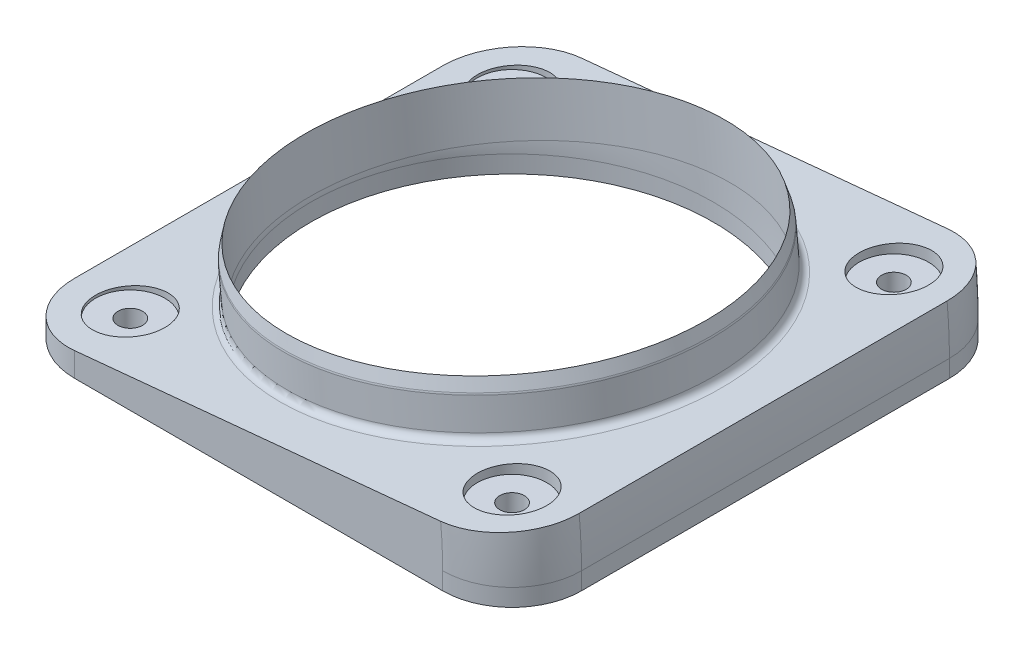
ISO-10303-21;
HEADER;
FILE_DESCRIPTION(('STEP AP214'),'2;1');
FILE_NAME('part.step','',(''),(''),'','','');
FILE_SCHEMA(('AUTOMOTIVE_DESIGN { 1 0 10303 214 1 1 1 1 }'));
ENDSEC;
DATA;
#1=APPLICATION_CONTEXT('core data for automotive mechanical design processes');
#2=APPLICATION_PROTOCOL_DEFINITION('international standard','automotive_design',2000,#1);
#3=PRODUCT_CONTEXT('',#1,'mechanical');
#4=PRODUCT('Part','Part','',(#3));
#5=PRODUCT_RELATED_PRODUCT_CATEGORY('part','',(#4));
#6=PRODUCT_DEFINITION_FORMATION('','',#4);
#7=PRODUCT_DEFINITION_CONTEXT('part definition',#1,'design');
#8=PRODUCT_DEFINITION('design','',#6,#7);
#9=PRODUCT_DEFINITION_SHAPE('','',#8);
#10=(LENGTH_UNIT() NAMED_UNIT(*) SI_UNIT(.MILLI.,.METRE.));
#11=(NAMED_UNIT(*) PLANE_ANGLE_UNIT() SI_UNIT($,.RADIAN.));
#12=(NAMED_UNIT(*) SI_UNIT($,.STERADIAN.) SOLID_ANGLE_UNIT());
#13=UNCERTAINTY_MEASURE_WITH_UNIT(LENGTH_MEASURE(1.E-05),#10,'distance_accuracy_value','');
#14=(GEOMETRIC_REPRESENTATION_CONTEXT(3) GLOBAL_UNCERTAINTY_ASSIGNED_CONTEXT((#13)) GLOBAL_UNIT_ASSIGNED_CONTEXT((#10,
#11,#12)) REPRESENTATION_CONTEXT('',''));
#15=CARTESIAN_POINT('',(0.,0.,0.));
#16=DIRECTION('',(0.,0.,1.));
#17=DIRECTION('',(1.,0.,0.));
#18=AXIS2_PLACEMENT_3D('',#15,#16,#17);
#19=CARTESIAN_POINT('',(-0.213409224689429,4.44292985807499,0.));
#20=DIRECTION('',(-0.0958457525202242,0.995396198367179,0.));
#21=DIRECTION('',(0.,0.,1.));
#22=AXIS2_PLACEMENT_3D('',#19,#20,#21);
#23=PLANE('',#22);
#24=CARTESIAN_POINT('',(34.9250000000004,7.82637383749599,34.9249999999996));
#25=DIRECTION('',(-0.0958457525202242,0.995396198367179,0.));
#26=DIRECTION('',(-0.995396198367179,-0.0958457525202242,0.));
#27=AXIS2_PLACEMENT_3D('',#24,#25,#26);
#28=ELLIPSE('',#27,6.37936935103467,6.35);
#29=CARTESIAN_POINT('',(28.5750000000003,7.21493838144162,34.9249999999996));
#30=VERTEX_POINT('',#29);
#31=EDGE_CURVE('E37',#30,#30,#28,.T.);
#32=ORIENTED_EDGE('',*,*,#31,.F.);
#33=EDGE_LOOP('',(#32));
#34=FACE_BOUND('',#33,.T.);
#35=CARTESIAN_POINT('',(34.925,7.82637383749596,-34.925));
#36=DIRECTION('',(-0.0958457525202242,0.995396198367179,0.));
#37=DIRECTION('',(-0.995396198367179,-0.0958457525202242,0.));
#38=AXIS2_PLACEMENT_3D('',#35,#36,#37);
#39=ELLIPSE('',#38,6.37936935103467,6.35);
#40=CARTESIAN_POINT('',(28.575,7.21493838144158,-34.925));
#41=VERTEX_POINT('',#40);
#42=EDGE_CURVE('E207',#41,#41,#39,.T.);
#43=ORIENTED_EDGE('',*,*,#42,.F.);
#44=EDGE_LOOP('',(#43));
#45=FACE_BOUND('',#44,.T.);
#46=CARTESIAN_POINT('',(-34.9250000000001,1.10058382089786,-34.9249999999999));
#47=DIRECTION('',(-0.0958457525202242,0.995396198367179,0.));
#48=DIRECTION('',(-0.995396198367179,-0.0958457525202242,0.));
#49=AXIS2_PLACEMENT_3D('',#46,#47,#48);
#50=ELLIPSE('',#49,6.37936935103467,6.35);
#51=CARTESIAN_POINT('',(-41.2750000000001,0.489148364843487,-34.9249999999999));
#52=VERTEX_POINT('',#51);
#53=EDGE_CURVE('E200',#52,#52,#50,.T.);
#54=ORIENTED_EDGE('',*,*,#53,.F.);
#55=EDGE_LOOP('',(#54));
#56=FACE_BOUND('',#55,.T.);
#57=CARTESIAN_POINT('',(-34.925,1.10058382089787,34.925));
#58=DIRECTION('',(-0.0958457525202242,0.995396198367179,0.));
#59=DIRECTION('',(-0.995396198367179,-0.0958457525202242,0.));
#60=AXIS2_PLACEMENT_3D('',#57,#58,#59);
#61=ELLIPSE('',#60,6.37936935103467,6.35);
#62=CARTESIAN_POINT('',(-41.275,0.489148364843497,34.925));
#63=VERTEX_POINT('',#62);
#64=EDGE_CURVE('E193',#63,#63,#61,.T.);
#65=ORIENTED_EDGE('',*,*,#64,.F.);
#66=EDGE_LOOP('',(#65));
#67=FACE_BOUND('',#66,.T.);
#68=CARTESIAN_POINT('',(-0.213409224689429,4.44292985807499,0.));
#69=DIRECTION('',(-0.0958457525202242,0.995396198367179,0.));
#70=DIRECTION('',(-0.995396198367179,-0.0958457525202242,0.));
#71=AXIS2_PLACEMENT_3D('',#68,#69,#70);
#72=CIRCLE('',#71,38.735);
#73=CARTESIAN_POINT('',(-38.7700809684421,0.730344634204105,0.));
#74=VERTEX_POINT('',#73);
#75=EDGE_CURVE('E11',#74,#74,#72,.F.);
#76=ORIENTED_EDGE('',*,*,#75,.T.);
#77=EDGE_LOOP('',(#76));
#78=FACE_BOUND('',#77,.T.);
#79=DIRECTION('',(0.995396198367179,0.0958457525202242,0.));
#80=VECTOR('',#79,1.);
#81=CARTESIAN_POINT('',(45.9281815506211,8.88585971614999,46.355));
#82=LINE('',#81,#80);
#83=CARTESIAN_POINT('',(-33.655,1.22287091210875,46.355));
#84=VERTEX_POINT('',#83);
#85=CARTESIAN_POINT('',(33.286649831358,7.66861865914314,46.355));
#86=VERTEX_POINT('',#85);
#87=EDGE_CURVE('E120',#84,#86,#82,.T.);
#88=ORIENTED_EDGE('',*,*,#87,.T.);
#89=CARTESIAN_POINT('',(33.286649831358,7.66861865914314,33.655));
#90=DIRECTION('',(-0.0958457525202242,0.995396198367179,0.));
#91=DIRECTION('',(-0.995396198367179,-0.0958457525202242,0.));
#92=AXIS2_PLACEMENT_3D('',#89,#90,#91);
#93=CIRCLE('',#92,12.7);
#94=CARTESIAN_POINT('',(45.9281815506211,8.88585971614999,33.655));
#95=VERTEX_POINT('',#94);
#96=EDGE_CURVE('E115',#86,#95,#93,.T.);
#97=ORIENTED_EDGE('',*,*,#96,.T.);
#98=DIRECTION('',(0.,0.,-1.));
#99=VECTOR('',#98,1.);
#100=CARTESIAN_POINT('',(45.9281815506211,8.88585971614999,46.355));
#101=LINE('',#100,#99);
#102=CARTESIAN_POINT('',(45.9281815506211,8.88585971614999,-33.655));
#103=VERTEX_POINT('',#102);
#104=EDGE_CURVE('E117',#95,#103,#101,.T.);
#105=ORIENTED_EDGE('',*,*,#104,.T.);
#106=CARTESIAN_POINT('',(33.286649831358,7.66861865914314,-33.655));
#107=DIRECTION('',(-0.0958457525202242,0.995396198367179,0.));
#108=DIRECTION('',(-0.995396198367179,-0.0958457525202242,0.));
#109=AXIS2_PLACEMENT_3D('',#106,#107,#108);
#110=CIRCLE('',#109,12.7);
#111=CARTESIAN_POINT('',(33.286649831358,7.66861865914314,-46.355));
#112=VERTEX_POINT('',#111);
#113=EDGE_CURVE('E125',#103,#112,#110,.T.);
#114=ORIENTED_EDGE('',*,*,#113,.T.);
#115=DIRECTION('',(-0.995396198367179,-0.0958457525202242,0.));
#116=VECTOR('',#115,1.);
#117=CARTESIAN_POINT('',(45.9281815506211,8.88585971614999,-46.355));
#118=LINE('',#117,#116);
#119=CARTESIAN_POINT('',(-33.655,1.22287091210875,-46.355));
#120=VERTEX_POINT('',#119);
#121=EDGE_CURVE('E134',#112,#120,#118,.T.);
#122=ORIENTED_EDGE('',*,*,#121,.T.);
#123=CARTESIAN_POINT('',(-33.655,1.22287091210874,-33.655));
#124=DIRECTION('',(-0.0958457525202242,0.995396198367179,0.));
#125=DIRECTION('',(0.995396198367179,0.0958457525202242,0.));
#126=AXIS2_PLACEMENT_3D('',#123,#124,#125);
#127=ELLIPSE('',#126,12.7587387020693,12.7);
#128=CARTESIAN_POINT('',(-46.355,0.,-33.655));
#129=VERTEX_POINT('',#128);
#130=EDGE_CURVE('E152',#120,#129,#127,.T.);
#131=ORIENTED_EDGE('',*,*,#130,.T.);
#132=DIRECTION('',(0.,0.,1.));
#133=VECTOR('',#132,1.);
#134=CARTESIAN_POINT('',(-46.355,0.,46.355));
#135=LINE('',#134,#133);
#136=CARTESIAN_POINT('',(-46.355,0.,33.655));
#137=VERTEX_POINT('',#136);
#138=EDGE_CURVE('E252',#129,#137,#135,.T.);
#139=ORIENTED_EDGE('',*,*,#138,.T.);
#140=CARTESIAN_POINT('',(-33.655,1.22287091210874,33.655));
#141=DIRECTION('',(-0.0958457525202242,0.995396198367179,0.));
#142=DIRECTION('',(0.995396198367179,0.0958457525202242,0.));
#143=AXIS2_PLACEMENT_3D('',#140,#141,#142);
#144=ELLIPSE('',#143,12.7587387020693,12.7);
#145=EDGE_CURVE('E150',#137,#84,#144,.T.);
#146=ORIENTED_EDGE('',*,*,#145,.T.);
#147=EDGE_LOOP('',(#88,#97,#105,#114,#122,#131,#139,#146));
#148=FACE_BOUND('',#147,.T.);
#149=ADVANCED_FACE('F33',(#34,#45,#56,#67,#78,#148),#23,.T.);
#150=CARTESIAN_POINT('',(-46.355,-3.175,46.355));
#151=DIRECTION('',(-1.,0.,0.));
#152=DIRECTION('',(0.,0.,1.));
#153=AXIS2_PLACEMENT_3D('',#150,#151,#152);
#154=PLANE('',#153);
#155=ORIENTED_EDGE('',*,*,#138,.F.);
#156=DIRECTION('',(0.,1.,0.));
#157=VECTOR('',#156,1.);
#158=CARTESIAN_POINT('',(-46.355,-3.175,-33.655));
#159=LINE('',#158,#157);
#160=CARTESIAN_POINT('',(-46.355,-3.175,-33.655));
#161=VERTEX_POINT('',#160);
#162=EDGE_CURVE('E165',#129,#161,#159,.F.);
#163=ORIENTED_EDGE('',*,*,#162,.T.);
#164=DIRECTION('',(0.,0.,1.));
#165=VECTOR('',#164,1.);
#166=CARTESIAN_POINT('',(-46.355,-3.175,46.355));
#167=LINE('',#166,#165);
#168=CARTESIAN_POINT('',(-46.355,-3.175,33.655));
#169=VERTEX_POINT('',#168);
#170=EDGE_CURVE('E253',#161,#169,#167,.T.);
#171=ORIENTED_EDGE('',*,*,#170,.T.);
#172=DIRECTION('',(0.,1.,0.));
#173=VECTOR('',#172,1.);
#174=CARTESIAN_POINT('',(-46.355,-3.175,33.655));
#175=LINE('',#174,#173);
#176=EDGE_CURVE('E162',#169,#137,#175,.T.);
#177=ORIENTED_EDGE('',*,*,#176,.T.);
#178=EDGE_LOOP('',(#155,#163,#171,#177));
#179=FACE_BOUND('',#178,.T.);
#180=ADVANCED_FACE('F281',(#179),#154,.T.);
#181=CARTESIAN_POINT('',(46.355,-3.175,-46.355));
#182=DIRECTION('',(0.,0.,-1.));
#183=DIRECTION('',(-1.,0.,0.));
#184=AXIS2_PLACEMENT_3D('',#181,#182,#183);
#185=PLANE('',#184);
#186=DIRECTION('',(-1.,0.,0.));
#187=VECTOR('',#186,1.);
#188=CARTESIAN_POINT('',(46.355,-3.175,-46.355));
#189=LINE('',#188,#187);
#190=CARTESIAN_POINT('',(33.655,-3.175,-46.355));
#191=VERTEX_POINT('',#190);
#192=CARTESIAN_POINT('',(-33.655,-3.175,-46.355));
#193=VERTEX_POINT('',#192);
#194=EDGE_CURVE('E143',#191,#193,#189,.T.);
#195=ORIENTED_EDGE('',*,*,#194,.T.);
#196=DIRECTION('',(0.,1.,0.));
#197=VECTOR('',#196,1.);
#198=CARTESIAN_POINT('',(-33.655,-3.175,-46.355));
#199=LINE('',#198,#197);
#200=EDGE_CURVE('E159',#193,#120,#199,.T.);
#201=ORIENTED_EDGE('',*,*,#200,.T.);
#202=ORIENTED_EDGE('',*,*,#121,.F.);
#203=CARTESIAN_POINT('',(-46.355,0.,-46.355));
#204=DIRECTION('',(0.,0.,-1.));
#205=DIRECTION('',(-1.,0.,0.));
#206=AXIS2_PLACEMENT_3D('',#203,#204,#205);
#207=CIRCLE('',#206,80.01);
#208=CARTESIAN_POINT('',(33.655,0.,-46.355));
#209=VERTEX_POINT('',#208);
#210=EDGE_CURVE('E156',#112,#209,#207,.T.);
#211=ORIENTED_EDGE('',*,*,#210,.T.);
#212=DIRECTION('',(0.,1.,0.));
#213=VECTOR('',#212,1.);
#214=CARTESIAN_POINT('',(33.655,-3.175,-46.355));
#215=LINE('',#214,#213);
#216=EDGE_CURVE('E124',#209,#191,#215,.F.);
#217=ORIENTED_EDGE('',*,*,#216,.T.);
#218=EDGE_LOOP('',(#195,#201,#202,#211,#217));
#219=FACE_BOUND('',#218,.T.);
#220=ADVANCED_FACE('F275',(#219),#185,.T.);
#221=CARTESIAN_POINT('',(46.355,-3.175,46.355));
#222=DIRECTION('',(1.,0.,0.));
#223=DIRECTION('',(0.,0.,-1.));
#224=AXIS2_PLACEMENT_3D('',#221,#222,#223);
#225=PLANE('',#224);
#226=DIRECTION('',(0.,0.,-1.));
#227=VECTOR('',#226,1.);
#228=CARTESIAN_POINT('',(46.355,0.,46.355));
#229=LINE('',#228,#227);
#230=CARTESIAN_POINT('',(46.355,0.,33.655));
#231=VERTEX_POINT('',#230);
#232=CARTESIAN_POINT('',(46.355,0.,-33.655));
#233=VERTEX_POINT('',#232);
#234=EDGE_CURVE('E257',#231,#233,#229,.T.);
#235=ORIENTED_EDGE('',*,*,#234,.F.);
#236=DIRECTION('',(0.,1.,0.));
#237=VECTOR('',#236,1.);
#238=CARTESIAN_POINT('',(46.355,-3.175,33.655));
#239=LINE('',#238,#237);
#240=CARTESIAN_POINT('',(46.355,-3.175,33.655));
#241=VERTEX_POINT('',#240);
#242=EDGE_CURVE('E57',#231,#241,#239,.F.);
#243=ORIENTED_EDGE('',*,*,#242,.T.);
#244=DIRECTION('',(0.,0.,-1.));
#245=VECTOR('',#244,1.);
#246=CARTESIAN_POINT('',(46.355,-3.175,46.355));
#247=LINE('',#246,#245);
#248=CARTESIAN_POINT('',(46.355,-3.175,-33.655));
#249=VERTEX_POINT('',#248);
#250=EDGE_CURVE('E260',#241,#249,#247,.T.);
#251=ORIENTED_EDGE('',*,*,#250,.T.);
#252=DIRECTION('',(0.,1.,0.));
#253=VECTOR('',#252,1.);
#254=CARTESIAN_POINT('',(46.355,-3.175,-33.655));
#255=LINE('',#254,#253);
#256=EDGE_CURVE('E174',#249,#233,#255,.T.);
#257=ORIENTED_EDGE('',*,*,#256,.T.);
#258=EDGE_LOOP('',(#235,#243,#251,#257));
#259=FACE_BOUND('',#258,.T.);
#260=ADVANCED_FACE('F298',(#259),#225,.T.);
#261=CARTESIAN_POINT('',(46.355,-3.175,46.355));
#262=DIRECTION('',(0.,0.,1.));
#263=DIRECTION('',(1.,0.,0.));
#264=AXIS2_PLACEMENT_3D('',#261,#262,#263);
#265=PLANE('',#264);
#266=ORIENTED_EDGE('',*,*,#87,.F.);
#267=DIRECTION('',(0.,1.,0.));
#268=VECTOR('',#267,1.);
#269=CARTESIAN_POINT('',(-33.655,-3.175,46.355));
#270=LINE('',#269,#268);
#271=CARTESIAN_POINT('',(-33.655,-3.175,46.355));
#272=VERTEX_POINT('',#271);
#273=EDGE_CURVE('E148',#84,#272,#270,.F.);
#274=ORIENTED_EDGE('',*,*,#273,.T.);
#275=DIRECTION('',(1.,0.,0.));
#276=VECTOR('',#275,1.);
#277=CARTESIAN_POINT('',(46.355,-3.175,46.355));
#278=LINE('',#277,#276);
#279=CARTESIAN_POINT('',(33.655,-3.175,46.355));
#280=VERTEX_POINT('',#279);
#281=EDGE_CURVE('E256',#272,#280,#278,.T.);
#282=ORIENTED_EDGE('',*,*,#281,.T.);
#283=DIRECTION('',(0.,1.,0.));
#284=VECTOR('',#283,1.);
#285=CARTESIAN_POINT('',(33.655,-3.175,46.355));
#286=LINE('',#285,#284);
#287=CARTESIAN_POINT('',(33.655,0.,46.355));
#288=VERTEX_POINT('',#287);
#289=EDGE_CURVE('E139',#280,#288,#286,.T.);
#290=ORIENTED_EDGE('',*,*,#289,.T.);
#291=CARTESIAN_POINT('',(-46.355,0.,46.355));
#292=DIRECTION('',(0.,0.,1.));
#293=DIRECTION('',(1.,0.,0.));
#294=AXIS2_PLACEMENT_3D('',#291,#292,#293);
#295=CIRCLE('',#294,80.01);
#296=EDGE_CURVE('E141',#288,#86,#295,.T.);
#297=ORIENTED_EDGE('',*,*,#296,.T.);
#298=EDGE_LOOP('',(#266,#274,#282,#290,#297));
#299=FACE_BOUND('',#298,.T.);
#300=ADVANCED_FACE('F293',(#299),#265,.T.);
#301=CARTESIAN_POINT('',(0.,-3.175,0.));
#302=DIRECTION('',(0.,1.,0.));
#303=DIRECTION('',(0.,0.,1.));
#304=AXIS2_PLACEMENT_3D('',#301,#302,#303);
#305=PLANE('',#304);
#306=CARTESIAN_POINT('',(34.9250000000004,-3.175,34.9249999999996));
#307=DIRECTION('',(0.,-1.,0.));
#308=DIRECTION('',(1.,0.,0.));
#309=AXIS2_PLACEMENT_3D('',#306,#307,#308);
#310=CIRCLE('',#309,2.25);
#311=CARTESIAN_POINT('',(37.1750000000004,-3.175,34.9249999999996));
#312=VERTEX_POINT('',#311);
#313=EDGE_CURVE('E179',#312,#312,#310,.T.);
#314=ORIENTED_EDGE('',*,*,#313,.F.);
#315=EDGE_LOOP('',(#314));
#316=FACE_BOUND('',#315,.T.);
#317=CARTESIAN_POINT('',(-34.925,-3.175,34.925));
#318=DIRECTION('',(0.,-1.,0.));
#319=DIRECTION('',(0.,0.,1.));
#320=AXIS2_PLACEMENT_3D('',#317,#318,#319);
#321=CIRCLE('',#320,2.25);
#322=CARTESIAN_POINT('',(-34.925,-3.175,37.175));
#323=VERTEX_POINT('',#322);
#324=EDGE_CURVE('E231',#323,#323,#321,.T.);
#325=ORIENTED_EDGE('',*,*,#324,.F.);
#326=EDGE_LOOP('',(#325));
#327=FACE_BOUND('',#326,.T.);
#328=CARTESIAN_POINT('',(-34.9250000000001,-3.175,-34.9249999999999));
#329=DIRECTION('',(0.,-1.,0.));
#330=DIRECTION('',(-1.,0.,0.));
#331=AXIS2_PLACEMENT_3D('',#328,#329,#330);
#332=CIRCLE('',#331,2.25);
#333=CARTESIAN_POINT('',(-37.1750000000001,-3.175,-34.9249999999999));
#334=VERTEX_POINT('',#333);
#335=EDGE_CURVE('E234',#334,#334,#332,.T.);
#336=ORIENTED_EDGE('',*,*,#335,.F.);
#337=EDGE_LOOP('',(#336));
#338=FACE_BOUND('',#337,.T.);
#339=CARTESIAN_POINT('',(34.925,-3.175,-34.925));
#340=DIRECTION('',(0.,-1.,0.));
#341=DIRECTION('',(0.,0.,-1.));
#342=AXIS2_PLACEMENT_3D('',#339,#340,#341);
#343=CIRCLE('',#342,2.25);
#344=CARTESIAN_POINT('',(34.925,-3.175,-37.175));
#345=VERTEX_POINT('',#344);
#346=EDGE_CURVE('E237',#345,#345,#343,.T.);
#347=ORIENTED_EDGE('',*,*,#346,.F.);
#348=EDGE_LOOP('',(#347));
#349=FACE_BOUND('',#348,.T.);
#350=CARTESIAN_POINT('',(0.,-3.175,0.));
#351=DIRECTION('',(0.,1.,0.));
#352=DIRECTION('',(0.,0.,1.));
#353=AXIS2_PLACEMENT_3D('',#350,#351,#352);
#354=CIRCLE('',#353,36.83);
#355=CARTESIAN_POINT('',(0.,-3.175,36.83));
#356=VERTEX_POINT('',#355);
#357=EDGE_CURVE('E249',#356,#356,#354,.T.);
#358=ORIENTED_EDGE('',*,*,#357,.T.);
#359=EDGE_LOOP('',(#358));
#360=FACE_BOUND('',#359,.T.);
#361=ORIENTED_EDGE('',*,*,#170,.F.);
#362=CARTESIAN_POINT('',(-33.655,-3.175,-33.655));
#363=DIRECTION('',(0.,1.,0.));
#364=DIRECTION('',(0.,0.,1.));
#365=AXIS2_PLACEMENT_3D('',#362,#363,#364);
#366=CIRCLE('',#365,12.7);
#367=EDGE_CURVE('E172',#161,#193,#366,.F.);
#368=ORIENTED_EDGE('',*,*,#367,.T.);
#369=ORIENTED_EDGE('',*,*,#194,.F.);
#370=CARTESIAN_POINT('',(33.655,-3.175,-33.655));
#371=DIRECTION('',(0.,1.,0.));
#372=DIRECTION('',(0.,0.,1.));
#373=AXIS2_PLACEMENT_3D('',#370,#371,#372);
#374=CIRCLE('',#373,12.7);
#375=EDGE_CURVE('E50',#191,#249,#374,.F.);
#376=ORIENTED_EDGE('',*,*,#375,.T.);
#377=ORIENTED_EDGE('',*,*,#250,.F.);
#378=CARTESIAN_POINT('',(33.655,-3.175,33.655));
#379=DIRECTION('',(0.,1.,0.));
#380=DIRECTION('',(0.,0.,1.));
#381=AXIS2_PLACEMENT_3D('',#378,#379,#380);
#382=CIRCLE('',#381,12.7);
#383=EDGE_CURVE('E168',#241,#280,#382,.F.);
#384=ORIENTED_EDGE('',*,*,#383,.T.);
#385=ORIENTED_EDGE('',*,*,#281,.F.);
#386=CARTESIAN_POINT('',(-33.655,-3.175,33.655));
#387=DIRECTION('',(0.,1.,0.));
#388=DIRECTION('',(0.,0.,1.));
#389=AXIS2_PLACEMENT_3D('',#386,#387,#388);
#390=CIRCLE('',#389,12.7);
#391=EDGE_CURVE('E170',#272,#169,#390,.F.);
#392=ORIENTED_EDGE('',*,*,#391,.T.);
#393=EDGE_LOOP('',(#361,#368,#369,#376,#377,#384,#385,#392));
#394=FACE_BOUND('',#393,.T.);
#395=ADVANCED_FACE('F286',(#316,#327,#338,#349,#360,#394),#305,.F.);
#396=CARTESIAN_POINT('',(0.,-3.175,0.));
#397=DIRECTION('',(0.,1.,0.));
#398=DIRECTION('',(0.,0.,1.));
#399=AXIS2_PLACEMENT_3D('',#396,#397,#398);
#400=CYLINDRICAL_SURFACE('',#399,36.83);
#401=ORIENTED_EDGE('',*,*,#357,.F.);
#402=EDGE_LOOP('',(#401));
#403=FACE_BOUND('',#402,.T.);
#404=CARTESIAN_POINT('',(0.,0.,0.));
#405=DIRECTION('',(0.,1.,0.));
#406=DIRECTION('',(0.,0.,1.));
#407=AXIS2_PLACEMENT_3D('',#404,#405,#406);
#408=CIRCLE('',#407,36.83);
#409=CARTESIAN_POINT('',(36.83,0.,0.));
#410=VERTEX_POINT('',#409);
#411=EDGE_CURVE('E240',#410,#410,#408,.T.);
#412=ORIENTED_EDGE('',*,*,#411,.T.);
#413=EDGE_LOOP('',(#412));
#414=FACE_BOUND('',#413,.T.);
#415=ADVANCED_FACE('F326',(#403,#414),#400,.F.);
#416=CARTESIAN_POINT('',(-46.355,0.,46.355));
#417=DIRECTION('',(0.,0.,-1.));
#418=DIRECTION('',(-1.,0.,0.));
#419=AXIS2_PLACEMENT_3D('',#416,#417,#418);
#420=CYLINDRICAL_SURFACE('',#419,92.71);
#421=ORIENTED_EDGE('',*,*,#104,.F.);
#422=CARTESIAN_POINT('',(-46.355,0.,33.655));
#423=DIRECTION('',(0.,0.,1.));
#424=DIRECTION('',(1.,0.,0.));
#425=AXIS2_PLACEMENT_3D('',#422,#423,#424);
#426=CIRCLE('',#425,92.71);
#427=EDGE_CURVE('E131',#95,#231,#426,.F.);
#428=ORIENTED_EDGE('',*,*,#427,.T.);
#429=ORIENTED_EDGE('',*,*,#234,.T.);
#430=CARTESIAN_POINT('',(-46.355,0.,-33.655));
#431=DIRECTION('',(0.,0.,-1.));
#432=DIRECTION('',(-1.,0.,0.));
#433=AXIS2_PLACEMENT_3D('',#430,#431,#432);
#434=CIRCLE('',#433,92.71);
#435=EDGE_CURVE('E133',#233,#103,#434,.F.);
#436=ORIENTED_EDGE('',*,*,#435,.T.);
#437=EDGE_LOOP('',(#421,#428,#429,#436));
#438=FACE_BOUND('',#437,.T.);
#439=ADVANCED_FACE('F129',(#438),#420,.T.);
#440=CARTESIAN_POINT('',(-46.355,0.,0.));
#441=DIRECTION('',(0.,0.,-1.));
#442=DIRECTION('',(-1.,0.,0.));
#443=AXIS2_PLACEMENT_3D('',#440,#441,#442);
#444=TOROIDAL_SURFACE('',#443,46.355,36.83);
#445=CARTESIAN_POINT('',(-0.213409224689429,4.44292985807499,0.));
#446=DIRECTION('',(-0.0958457525202242,0.995396198367179,0.));
#447=DIRECTION('',(0.,0.,1.));
#448=AXIS2_PLACEMENT_3D('',#445,#446,#447);
#449=CIRCLE('',#448,36.83);
#450=CARTESIAN_POINT('',(36.4470327611738,7.97292892339485,0.));
#451=VERTEX_POINT('',#450);
#452=EDGE_CURVE('E243',#451,#451,#449,.T.);
#453=CARTESIAN_POINT('',(-46.355,0.,0.));
#454=DIRECTION('',(0.,0.,-1.));
#455=DIRECTION('',(-1.,0.,0.));
#456=AXIS2_PLACEMENT_3D('',#453,#454,#455);
#457=CIRCLE('',#456,83.185);
#458=EDGE_CURVE('',#451,#410,#457,.T.);
#459=ORIENTED_EDGE('',*,*,#452,.T.);
#460=ORIENTED_EDGE('',*,*,#411,.F.);
#461=ORIENTED_EDGE('',*,*,#458,.T.);
#462=ORIENTED_EDGE('',*,*,#458,.F.);
#463=EDGE_LOOP('',(#459,#461,#460,#462));
#464=FACE_BOUND('',#463,.T.);
#465=ADVANCED_FACE('F320',(#464),#444,.F.);
#466=CARTESIAN_POINT('',(34.925,8.88585971614999,-34.925));
#467=DIRECTION('',(0.,-1.,0.));
#468=DIRECTION('',(0.,0.,-1.));
#469=AXIS2_PLACEMENT_3D('',#466,#467,#468);
#470=CYLINDRICAL_SURFACE('',#469,2.25);
#471=CARTESIAN_POINT('',(34.925,5.715,-34.925));
#472=DIRECTION('',(0.,-1.,0.));
#473=DIRECTION('',(0.,0.,-1.));
#474=AXIS2_PLACEMENT_3D('',#471,#472,#473);
#475=CIRCLE('',#474,2.25);
#476=CARTESIAN_POINT('',(34.925,5.715,-37.175));
#477=VERTEX_POINT('',#476);
#478=EDGE_CURVE('E204',#477,#477,#475,.F.);
#479=ORIENTED_EDGE('',*,*,#478,.T.);
#480=EDGE_LOOP('',(#479));
#481=FACE_BOUND('',#480,.T.);
#482=ORIENTED_EDGE('',*,*,#346,.T.);
#483=EDGE_LOOP('',(#482));
#484=FACE_BOUND('',#483,.T.);
#485=ADVANCED_FACE('F318',(#481,#484),#470,.F.);
#486=CARTESIAN_POINT('',(-34.9250000000001,8.88585971614999,-34.9249999999999));
#487=DIRECTION('',(0.,-1.,0.));
#488=DIRECTION('',(0.,0.,-1.));
#489=AXIS2_PLACEMENT_3D('',#486,#487,#488);
#490=CYLINDRICAL_SURFACE('',#489,2.25);
#491=CARTESIAN_POINT('',(-34.9250000000001,0.,-34.9249999999999));
#492=DIRECTION('',(0.,-1.,0.));
#493=DIRECTION('',(0.,0.,-1.));
#494=AXIS2_PLACEMENT_3D('',#491,#492,#493);
#495=CIRCLE('',#494,2.25);
#496=CARTESIAN_POINT('',(-34.9250000000001,0.,-37.1749999999999));
#497=VERTEX_POINT('',#496);
#498=EDGE_CURVE('E197',#497,#497,#495,.F.);
#499=ORIENTED_EDGE('',*,*,#498,.T.);
#500=EDGE_LOOP('',(#499));
#501=FACE_BOUND('',#500,.T.);
#502=ORIENTED_EDGE('',*,*,#335,.T.);
#503=EDGE_LOOP('',(#502));
#504=FACE_BOUND('',#503,.T.);
#505=ADVANCED_FACE('F348',(#501,#504),#490,.F.);
#506=CARTESIAN_POINT('',(-34.925,8.88585971614999,34.925));
#507=DIRECTION('',(0.,-1.,0.));
#508=DIRECTION('',(0.,0.,-1.));
#509=AXIS2_PLACEMENT_3D('',#506,#507,#508);
#510=CYLINDRICAL_SURFACE('',#509,2.25);
#511=CARTESIAN_POINT('',(-34.925,0.,34.925));
#512=DIRECTION('',(0.,-1.,0.));
#513=DIRECTION('',(0.,0.,-1.));
#514=AXIS2_PLACEMENT_3D('',#511,#512,#513);
#515=CIRCLE('',#514,2.25);
#516=CARTESIAN_POINT('',(-34.925,0.,32.675));
#517=VERTEX_POINT('',#516);
#518=EDGE_CURVE('E190',#517,#517,#515,.F.);
#519=ORIENTED_EDGE('',*,*,#518,.T.);
#520=EDGE_LOOP('',(#519));
#521=FACE_BOUND('',#520,.T.);
#522=ORIENTED_EDGE('',*,*,#324,.T.);
#523=EDGE_LOOP('',(#522));
#524=FACE_BOUND('',#523,.T.);
#525=ADVANCED_FACE('F353',(#521,#524),#510,.F.);
#526=CARTESIAN_POINT('',(34.9250000000004,8.88585971614999,34.9249999999996));
#527=DIRECTION('',(0.,-1.,0.));
#528=DIRECTION('',(0.,0.,-1.));
#529=AXIS2_PLACEMENT_3D('',#526,#527,#528);
#530=CYLINDRICAL_SURFACE('',#529,2.25);
#531=CARTESIAN_POINT('',(34.9250000000004,5.715,34.9249999999996));
#532=DIRECTION('',(0.,-1.,0.));
#533=DIRECTION('',(0.,0.,-1.));
#534=AXIS2_PLACEMENT_3D('',#531,#532,#533);
#535=CIRCLE('',#534,2.25);
#536=CARTESIAN_POINT('',(34.9250000000004,5.715,32.6749999999996));
#537=VERTEX_POINT('',#536);
#538=EDGE_CURVE('E210',#537,#537,#535,.F.);
#539=ORIENTED_EDGE('',*,*,#538,.T.);
#540=EDGE_LOOP('',(#539));
#541=FACE_BOUND('',#540,.T.);
#542=ORIENTED_EDGE('',*,*,#313,.T.);
#543=EDGE_LOOP('',(#542));
#544=FACE_BOUND('',#543,.T.);
#545=ADVANCED_FACE('F402',(#541,#544),#530,.F.);
#546=CARTESIAN_POINT('',(33.655,-3.175,33.655));
#547=DIRECTION('',(0.,1.,0.));
#548=DIRECTION('',(0.,0.,1.));
#549=AXIS2_PLACEMENT_3D('',#546,#547,#548);
#550=CYLINDRICAL_SURFACE('',#549,12.7);
#551=ORIENTED_EDGE('',*,*,#383,.F.);
#552=ORIENTED_EDGE('',*,*,#242,.F.);
#553=CARTESIAN_POINT('',(33.655,0.,33.655));
#554=DIRECTION('',(0.,1.,0.));
#555=DIRECTION('',(0.,0.,1.));
#556=AXIS2_PLACEMENT_3D('',#553,#554,#555);
#557=CIRCLE('',#556,12.7);
#558=EDGE_CURVE('E138',#288,#231,#557,.T.);
#559=ORIENTED_EDGE('',*,*,#558,.F.);
#560=ORIENTED_EDGE('',*,*,#289,.F.);
#561=EDGE_LOOP('',(#551,#552,#559,#560));
#562=FACE_BOUND('',#561,.T.);
#563=ADVANCED_FACE('F297',(#562),#550,.T.);
#564=CARTESIAN_POINT('',(-46.355,0.,33.655));
#565=DIRECTION('',(0.,0.,1.));
#566=DIRECTION('',(1.,0.,0.));
#567=AXIS2_PLACEMENT_3D('',#564,#565,#566);
#568=TOROIDAL_SURFACE('',#567,80.01,12.7);
#569=ORIENTED_EDGE('',*,*,#96,.F.);
#570=ORIENTED_EDGE('',*,*,#296,.F.);
#571=ORIENTED_EDGE('',*,*,#558,.T.);
#572=ORIENTED_EDGE('',*,*,#427,.F.);
#573=EDGE_LOOP('',(#569,#570,#571,#572));
#574=FACE_BOUND('',#573,.T.);
#575=ADVANCED_FACE('F136',(#574),#568,.T.);
#576=CARTESIAN_POINT('',(33.655,-3.175,-33.655));
#577=DIRECTION('',(0.,1.,0.));
#578=DIRECTION('',(0.,0.,1.));
#579=AXIS2_PLACEMENT_3D('',#576,#577,#578);
#580=CYLINDRICAL_SURFACE('',#579,12.7);
#581=ORIENTED_EDGE('',*,*,#375,.F.);
#582=ORIENTED_EDGE('',*,*,#216,.F.);
#583=CARTESIAN_POINT('',(33.655,0.,-33.655));
#584=DIRECTION('',(0.,1.,0.));
#585=DIRECTION('',(0.,0.,1.));
#586=AXIS2_PLACEMENT_3D('',#583,#584,#585);
#587=CIRCLE('',#586,12.7);
#588=EDGE_CURVE('E180',#233,#209,#587,.T.);
#589=ORIENTED_EDGE('',*,*,#588,.F.);
#590=ORIENTED_EDGE('',*,*,#256,.F.);
#591=EDGE_LOOP('',(#581,#582,#589,#590));
#592=FACE_BOUND('',#591,.T.);
#593=ADVANCED_FACE('F272',(#592),#580,.T.);
#594=CARTESIAN_POINT('',(-46.355,0.,-33.655));
#595=DIRECTION('',(0.,0.,-1.));
#596=DIRECTION('',(-1.,0.,0.));
#597=AXIS2_PLACEMENT_3D('',#594,#595,#596);
#598=TOROIDAL_SURFACE('',#597,80.01,12.7);
#599=ORIENTED_EDGE('',*,*,#113,.F.);
#600=ORIENTED_EDGE('',*,*,#435,.F.);
#601=ORIENTED_EDGE('',*,*,#588,.T.);
#602=ORIENTED_EDGE('',*,*,#210,.F.);
#603=EDGE_LOOP('',(#599,#600,#601,#602));
#604=FACE_BOUND('',#603,.T.);
#605=ADVANCED_FACE('F267',(#604),#598,.T.);
#606=CARTESIAN_POINT('',(-33.655,-3.175,-33.655));
#607=DIRECTION('',(0.,1.,0.));
#608=DIRECTION('',(0.,0.,1.));
#609=AXIS2_PLACEMENT_3D('',#606,#607,#608);
#610=CYLINDRICAL_SURFACE('',#609,12.7);
#611=ORIENTED_EDGE('',*,*,#367,.F.);
#612=ORIENTED_EDGE('',*,*,#162,.F.);
#613=ORIENTED_EDGE('',*,*,#130,.F.);
#614=ORIENTED_EDGE('',*,*,#200,.F.);
#615=EDGE_LOOP('',(#611,#612,#613,#614));
#616=FACE_BOUND('',#615,.T.);
#617=ADVANCED_FACE('F285',(#616),#610,.T.);
#618=CARTESIAN_POINT('',(-33.655,-3.175,33.655));
#619=DIRECTION('',(0.,1.,0.));
#620=DIRECTION('',(0.,0.,1.));
#621=AXIS2_PLACEMENT_3D('',#618,#619,#620);
#622=CYLINDRICAL_SURFACE('',#621,12.7);
#623=ORIENTED_EDGE('',*,*,#391,.F.);
#624=ORIENTED_EDGE('',*,*,#273,.F.);
#625=ORIENTED_EDGE('',*,*,#145,.F.);
#626=ORIENTED_EDGE('',*,*,#176,.F.);
#627=EDGE_LOOP('',(#623,#624,#625,#626));
#628=FACE_BOUND('',#627,.T.);
#629=ADVANCED_FACE('F290',(#628),#622,.T.);
#630=CARTESIAN_POINT('',(96.0581792511767,-995.375743999444,0.));
#631=DIRECTION('',(0.0958457525202244,-0.995396198367179,0.));
#632=DIRECTION('',(0.995396198367179,0.0958457525202244,0.));
#633=AXIS2_PLACEMENT_3D('',#630,#631,#632);
#634=CYLINDRICAL_SURFACE('',#633,36.83);
#635=CARTESIAN_POINT('',(-1.12634001744459,13.9240786475225,0.));
#636=DIRECTION('',(0.0958457525202244,-0.995396198367179,0.));
#637=DIRECTION('',(0.995396198367179,0.0958457525202244,0.));
#638=AXIS2_PLACEMENT_3D('',#635,#636,#637);
#639=CIRCLE('',#638,36.83);
#640=CARTESIAN_POINT('',(35.5341019684186,17.4540777128424,0.));
#641=VERTEX_POINT('',#640);
#642=EDGE_CURVE('E182',#641,#641,#639,.T.);
#643=ORIENTED_EDGE('',*,*,#642,.F.);
#644=EDGE_LOOP('',(#643));
#645=FACE_BOUND('',#644,.T.);
#646=ORIENTED_EDGE('',*,*,#452,.F.);
#647=EDGE_LOOP('',(#646));
#648=FACE_BOUND('',#647,.T.);
#649=ADVANCED_FACE('F397',(#645,#648),#634,.F.);
#650=CARTESIAN_POINT('',(96.0581792511767,-995.375743999444,0.));
#651=DIRECTION('',(0.0958457525202244,-0.995396198367179,0.));
#652=DIRECTION('',(0.995396198367179,0.0958457525202244,0.));
#653=AXIS2_PLACEMENT_3D('',#650,#651,#652);
#654=CYLINDRICAL_SURFACE('',#653,37.465);
#655=CARTESIAN_POINT('',(-0.883174461422082,11.3987077920163,0.));
#656=DIRECTION('',(-0.0958457525202244,0.995396198367179,0.));
#657=DIRECTION('',(-0.995396198367179,-0.0958457525202244,0.));
#658=AXIS2_PLACEMENT_3D('',#655,#656,#657);
#659=CIRCLE('',#658,37.465);
#660=CARTESIAN_POINT('',(-38.1756930332485,7.80784667384614,0.));
#661=VERTEX_POINT('',#660);
#662=EDGE_CURVE('E185',#661,#661,#659,.F.);
#663=ORIENTED_EDGE('',*,*,#662,.T.);
#664=EDGE_LOOP('',(#663));
#665=FACE_BOUND('',#664,.T.);
#666=CARTESIAN_POINT('',(-0.335133330390106,5.70708303000123,0.));
#667=DIRECTION('',(-0.0958457525202242,0.995396198367179,0.));
#668=DIRECTION('',(-0.995396198367179,-0.0958457525202242,0.));
#669=AXIS2_PLACEMENT_3D('',#666,#667,#668);
#670=CIRCLE('',#669,37.465);
#671=CARTESIAN_POINT('',(-37.6276519022165,2.11622191183102,0.));
#672=VERTEX_POINT('',#671);
#673=EDGE_CURVE('E177',#672,#672,#670,.T.);
#674=ORIENTED_EDGE('',*,*,#673,.T.);
#675=EDGE_LOOP('',(#674));
#676=FACE_BOUND('',#675,.T.);
#677=ADVANCED_FACE('F393',(#665,#676),#654,.T.);
#678=CARTESIAN_POINT('',(-1.12634001744459,13.9240786475225,0.));
#679=DIRECTION('',(0.0958457525202244,-0.995396198367179,0.));
#680=DIRECTION('',(0.995396198367179,0.0958457525202244,0.));
#681=AXIS2_PLACEMENT_3D('',#678,#679,#680);
#682=CONICAL_SURFACE('',#681,36.83,0.261799387799158);
#683=CARTESIAN_POINT('',(-0.914678978225513,11.7258947088377,0.));
#684=DIRECTION('',(-0.0958457525202244,0.995396198367179,0.));
#685=DIRECTION('',(-0.995396198367179,-0.0958457525202244,0.));
#686=AXIS2_PLACEMENT_3D('',#683,#684,#685);
#687=CIRCLE('',#686,37.4217257993871);
#688=CARTESIAN_POINT('',(-38.1641225752744,8.13918123898997,0.));
#689=VERTEX_POINT('',#688);
#690=EDGE_CURVE('E42',#689,#689,#687,.T.);
#691=ORIENTED_EDGE('',*,*,#690,.T.);
#692=EDGE_LOOP('',(#691));
#693=FACE_BOUND('',#692,.T.);
#694=ORIENTED_EDGE('',*,*,#642,.T.);
#695=EDGE_LOOP('',(#694));
#696=FACE_BOUND('',#695,.T.);
#697=ADVANCED_FACE('F389',(#693,#696),#682,.T.);
#698=CARTESIAN_POINT('',(-0.883174461422095,11.3987077920165,0.));
#699=DIRECTION('',(-0.0958457525202244,0.995396198367179,0.));
#700=DIRECTION('',(-0.995396198367179,-0.0958457525202244,0.));
#701=AXIS2_PLACEMENT_3D('',#698,#699,#700);
#702=TOROIDAL_SURFACE('',#701,36.195,1.27);
#703=ORIENTED_EDGE('',*,*,#690,.F.);
#704=EDGE_LOOP('',(#703));
#705=FACE_BOUND('',#704,.T.);
#706=ORIENTED_EDGE('',*,*,#662,.F.);
#707=EDGE_LOOP('',(#706));
#708=FACE_BOUND('',#707,.T.);
#709=ADVANCED_FACE('F392',(#705,#708),#702,.T.);
#710=CARTESIAN_POINT('',(-0.335133330390106,5.70708303000123,0.));
#711=DIRECTION('',(-0.0958457525202242,0.995396198367179,0.));
#712=DIRECTION('',(-0.995396198367179,-0.0958457525202242,0.));
#713=AXIS2_PLACEMENT_3D('',#710,#711,#712);
#714=TOROIDAL_SURFACE('',#713,38.735,1.27);
#715=ORIENTED_EDGE('',*,*,#673,.F.);
#716=EDGE_LOOP('',(#715));
#717=FACE_BOUND('',#716,.T.);
#718=ORIENTED_EDGE('',*,*,#75,.F.);
#719=EDGE_LOOP('',(#718));
#720=FACE_BOUND('',#719,.T.);
#721=ADVANCED_FACE('F35',(#717,#720),#714,.F.);
#722=CARTESIAN_POINT('',(-34.925,0.,34.925));
#723=DIRECTION('',(0.,-1.,0.));
#724=DIRECTION('',(0.,0.,-1.));
#725=AXIS2_PLACEMENT_3D('',#722,#723,#724);
#726=PLANE('',#725);
#727=CARTESIAN_POINT('',(-34.925,0.,34.925));
#728=DIRECTION('',(0.,-1.,0.));
#729=DIRECTION('',(0.,0.,-1.));
#730=AXIS2_PLACEMENT_3D('',#727,#728,#729);
#731=CIRCLE('',#730,6.35);
#732=CARTESIAN_POINT('',(-34.925,0.,28.575));
#733=VERTEX_POINT('',#732);
#734=EDGE_CURVE('E194',#733,#733,#731,.T.);
#735=ORIENTED_EDGE('',*,*,#734,.F.);
#736=EDGE_LOOP('',(#735));
#737=FACE_BOUND('',#736,.T.);
#738=ORIENTED_EDGE('',*,*,#518,.F.);
#739=EDGE_LOOP('',(#738));
#740=FACE_BOUND('',#739,.T.);
#741=ADVANCED_FACE('F382',(#737,#740),#726,.F.);
#742=CARTESIAN_POINT('',(-34.925,17.4540777128424,34.925));
#743=DIRECTION('',(0.,-1.,0.));
#744=DIRECTION('',(0.,0.,-1.));
#745=AXIS2_PLACEMENT_3D('',#742,#743,#744);
#746=CYLINDRICAL_SURFACE('',#745,6.35);
#747=ORIENTED_EDGE('',*,*,#64,.T.);
#748=EDGE_LOOP('',(#747));
#749=FACE_BOUND('',#748,.T.);
#750=ORIENTED_EDGE('',*,*,#734,.T.);
#751=EDGE_LOOP('',(#750));
#752=FACE_BOUND('',#751,.T.);
#753=ADVANCED_FACE('F379',(#749,#752),#746,.F.);
#754=CARTESIAN_POINT('',(-34.9250000000001,0.,-34.9249999999999));
#755=DIRECTION('',(0.,-1.,0.));
#756=DIRECTION('',(0.,0.,-1.));
#757=AXIS2_PLACEMENT_3D('',#754,#755,#756);
#758=PLANE('',#757);
#759=CARTESIAN_POINT('',(-34.9250000000001,0.,-34.9249999999999));
#760=DIRECTION('',(0.,-1.,0.));
#761=DIRECTION('',(0.,0.,-1.));
#762=AXIS2_PLACEMENT_3D('',#759,#760,#761);
#763=CIRCLE('',#762,6.35);
#764=CARTESIAN_POINT('',(-34.9250000000001,0.,-41.2749999999999));
#765=VERTEX_POINT('',#764);
#766=EDGE_CURVE('E201',#765,#765,#763,.T.);
#767=ORIENTED_EDGE('',*,*,#766,.F.);
#768=EDGE_LOOP('',(#767));
#769=FACE_BOUND('',#768,.T.);
#770=ORIENTED_EDGE('',*,*,#498,.F.);
#771=EDGE_LOOP('',(#770));
#772=FACE_BOUND('',#771,.T.);
#773=ADVANCED_FACE('F370',(#769,#772),#758,.F.);
#774=CARTESIAN_POINT('',(-34.9250000000001,17.4540777128424,-34.9249999999999));
#775=DIRECTION('',(0.,-1.,0.));
#776=DIRECTION('',(0.,0.,-1.));
#777=AXIS2_PLACEMENT_3D('',#774,#775,#776);
#778=CYLINDRICAL_SURFACE('',#777,6.35);
#779=ORIENTED_EDGE('',*,*,#53,.T.);
#780=EDGE_LOOP('',(#779));
#781=FACE_BOUND('',#780,.T.);
#782=ORIENTED_EDGE('',*,*,#766,.T.);
#783=EDGE_LOOP('',(#782));
#784=FACE_BOUND('',#783,.T.);
#785=ADVANCED_FACE('F360',(#781,#784),#778,.F.);
#786=CARTESIAN_POINT('',(34.925,5.715,-34.925));
#787=DIRECTION('',(0.,-1.,0.));
#788=DIRECTION('',(0.,0.,-1.));
#789=AXIS2_PLACEMENT_3D('',#786,#787,#788);
#790=PLANE('',#789);
#791=CARTESIAN_POINT('',(34.925,5.715,-34.925));
#792=DIRECTION('',(0.,-1.,0.));
#793=DIRECTION('',(0.,0.,-1.));
#794=AXIS2_PLACEMENT_3D('',#791,#792,#793);
#795=CIRCLE('',#794,6.35);
#796=CARTESIAN_POINT('',(34.925,5.715,-41.275));
#797=VERTEX_POINT('',#796);
#798=EDGE_CURVE('E208',#797,#797,#795,.T.);
#799=ORIENTED_EDGE('',*,*,#798,.F.);
#800=EDGE_LOOP('',(#799));
#801=FACE_BOUND('',#800,.T.);
#802=ORIENTED_EDGE('',*,*,#478,.F.);
#803=EDGE_LOOP('',(#802));
#804=FACE_BOUND('',#803,.T.);
#805=ADVANCED_FACE('F357',(#801,#804),#790,.F.);
#806=CARTESIAN_POINT('',(34.925,17.4540777128424,-34.925));
#807=DIRECTION('',(0.,-1.,0.));
#808=DIRECTION('',(0.,0.,-1.));
#809=AXIS2_PLACEMENT_3D('',#806,#807,#808);
#810=CYLINDRICAL_SURFACE('',#809,6.35);
#811=ORIENTED_EDGE('',*,*,#42,.T.);
#812=EDGE_LOOP('',(#811));
#813=FACE_BOUND('',#812,.T.);
#814=ORIENTED_EDGE('',*,*,#798,.T.);
#815=EDGE_LOOP('',(#814));
#816=FACE_BOUND('',#815,.T.);
#817=ADVANCED_FACE('F359',(#813,#816),#810,.F.);
#818=CARTESIAN_POINT('',(34.9250000000004,5.715,34.9249999999996));
#819=DIRECTION('',(0.,-1.,0.));
#820=DIRECTION('',(0.,0.,-1.));
#821=AXIS2_PLACEMENT_3D('',#818,#819,#820);
#822=PLANE('',#821);
#823=CARTESIAN_POINT('',(34.9250000000004,5.715,34.9249999999996));
#824=DIRECTION('',(0.,-1.,0.));
#825=DIRECTION('',(0.,0.,-1.));
#826=AXIS2_PLACEMENT_3D('',#823,#824,#825);
#827=CIRCLE('',#826,6.35);
#828=CARTESIAN_POINT('',(34.9250000000004,5.715,28.5749999999996));
#829=VERTEX_POINT('',#828);
#830=EDGE_CURVE('E212',#829,#829,#827,.T.);
#831=ORIENTED_EDGE('',*,*,#830,.F.);
#832=EDGE_LOOP('',(#831));
#833=FACE_BOUND('',#832,.T.);
#834=ORIENTED_EDGE('',*,*,#538,.F.);
#835=EDGE_LOOP('',(#834));
#836=FACE_BOUND('',#835,.T.);
#837=ADVANCED_FACE('F367',(#833,#836),#822,.F.);
#838=CARTESIAN_POINT('',(34.9250000000004,17.4540777128424,34.9249999999996));
#839=DIRECTION('',(0.,-1.,0.));
#840=DIRECTION('',(0.,0.,-1.));
#841=AXIS2_PLACEMENT_3D('',#838,#839,#840);
#842=CYLINDRICAL_SURFACE('',#841,6.35);
#843=ORIENTED_EDGE('',*,*,#31,.T.);
#844=EDGE_LOOP('',(#843));
#845=FACE_BOUND('',#844,.T.);
#846=ORIENTED_EDGE('',*,*,#830,.T.);
#847=EDGE_LOOP('',(#846));
#848=FACE_BOUND('',#847,.T.);
#849=ADVANCED_FACE('F375',(#845,#848),#842,.F.);
#850=CLOSED_SHELL('',(#149,#180,#220,#260,#300,#395,#415,#439,#465,#485,#505,#525,#545,#563,
#575,#593,#605,#617,#629,#649,#677,#697,#709,#721,#741,#753,#773,#785,#805,#817,#837,#849));
#851=MANIFOLD_SOLID_BREP('B2',#850);
#852=ADVANCED_BREP_SHAPE_REPRESENTATION('',(#18,#851),#14);
#853=SHAPE_DEFINITION_REPRESENTATION(#9,#852);
ENDSEC;
END-ISO-10303-21;
